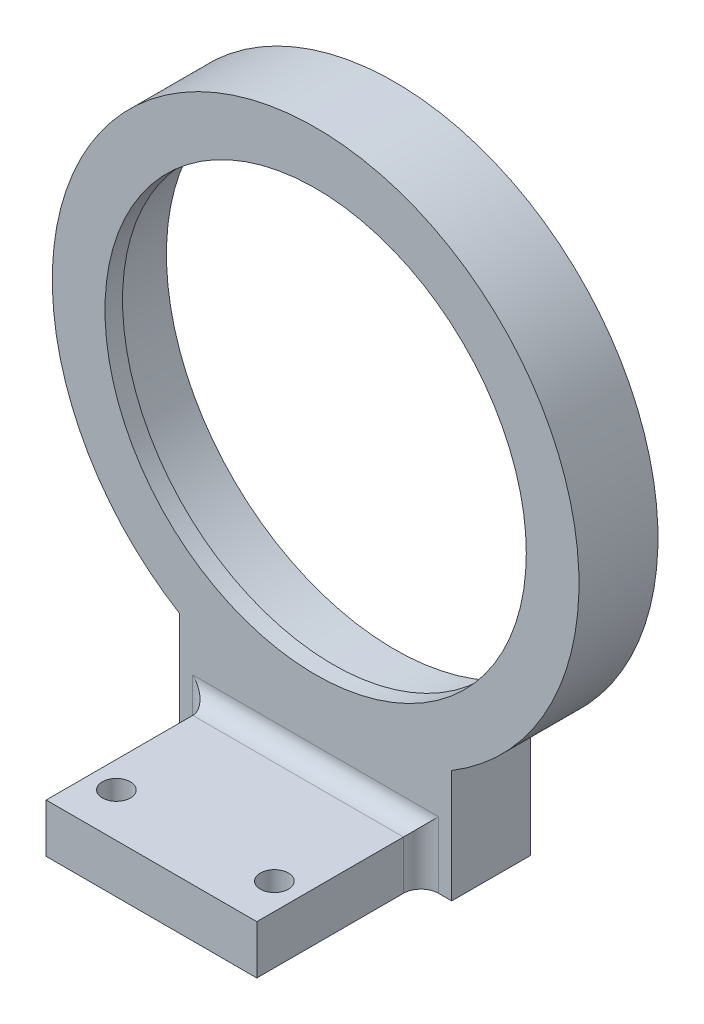
ISO-10303-21;
HEADER;
FILE_DESCRIPTION(('STEP AP214'),'2;1');
FILE_NAME('part.step','',(''),(''),'','','');
FILE_SCHEMA(('AUTOMOTIVE_DESIGN { 1 0 10303 214 1 1 1 1 }'));
ENDSEC;
DATA;
#1=APPLICATION_CONTEXT('core data for automotive mechanical design processes');
#2=APPLICATION_PROTOCOL_DEFINITION('international standard','automotive_design',2000,#1);
#3=PRODUCT_CONTEXT('',#1,'mechanical');
#4=PRODUCT('Part','Part','',(#3));
#5=PRODUCT_RELATED_PRODUCT_CATEGORY('part','',(#4));
#6=PRODUCT_DEFINITION_FORMATION('','',#4);
#7=PRODUCT_DEFINITION_CONTEXT('part definition',#1,'design');
#8=PRODUCT_DEFINITION('design','',#6,#7);
#9=PRODUCT_DEFINITION_SHAPE('','',#8);
#10=(LENGTH_UNIT() NAMED_UNIT(*) SI_UNIT(.MILLI.,.METRE.));
#11=(NAMED_UNIT(*) PLANE_ANGLE_UNIT() SI_UNIT($,.RADIAN.));
#12=(NAMED_UNIT(*) SI_UNIT($,.STERADIAN.) SOLID_ANGLE_UNIT());
#13=UNCERTAINTY_MEASURE_WITH_UNIT(LENGTH_MEASURE(1.E-05),#10,'distance_accuracy_value','');
#14=(GEOMETRIC_REPRESENTATION_CONTEXT(3) GLOBAL_UNCERTAINTY_ASSIGNED_CONTEXT((#13)) GLOBAL_UNIT_ASSIGNED_CONTEXT((#10,
#11,#12)) REPRESENTATION_CONTEXT('',''));
#15=CARTESIAN_POINT('',(0.,0.,0.));
#16=DIRECTION('',(0.,0.,1.));
#17=DIRECTION('',(1.,0.,0.));
#18=AXIS2_PLACEMENT_3D('',#15,#16,#17);
#19=CARTESIAN_POINT('',(-14.,0.,11.));
#20=DIRECTION('',(0.,1.,0.));
#21=DIRECTION('',(0.,0.,1.));
#22=AXIS2_PLACEMENT_3D('',#19,#20,#21);
#23=CYLINDRICAL_SURFACE('',#22,2.);
#24=DIRECTION('',(0.,1.,0.));
#25=VECTOR('',#24,1.);
#26=CARTESIAN_POINT('',(-14.,0.,9.));
#27=LINE('',#26,#25);
#28=CARTESIAN_POINT('',(-14.,-38.56,9.));
#29=VERTEX_POINT('',#28);
#30=CARTESIAN_POINT('',(-14.,-31.,9.));
#31=VERTEX_POINT('',#30);
#32=EDGE_CURVE('E215',#29,#31,#27,.T.);
#33=ORIENTED_EDGE('',*,*,#32,.F.);
#34=CARTESIAN_POINT('',(-14.,-38.56,11.));
#35=DIRECTION('',(0.,-1.,0.));
#36=DIRECTION('',(0.,0.,-1.));
#37=AXIS2_PLACEMENT_3D('',#34,#35,#36);
#38=CIRCLE('',#37,2.);
#39=CARTESIAN_POINT('',(-12.,-38.56,11.));
#40=VERTEX_POINT('',#39);
#41=EDGE_CURVE('E44',#29,#40,#38,.T.);
#42=ORIENTED_EDGE('',*,*,#41,.T.);
#43=DIRECTION('',(0.,1.,0.));
#44=VECTOR('',#43,1.);
#45=CARTESIAN_POINT('',(-12.,-38.,11.));
#46=LINE('',#45,#44);
#47=CARTESIAN_POINT('',(-12.,-33.,11.));
#48=VERTEX_POINT('',#47);
#49=EDGE_CURVE('E218',#48,#40,#46,.F.);
#50=ORIENTED_EDGE('',*,*,#49,.F.);
#51=CARTESIAN_POINT('',(-14.,-31.,11.));
#52=DIRECTION('',(0.707106781186547,0.707106781186547,0.));
#53=DIRECTION('',(0.707106781186547,-0.707106781186547,0.));
#54=AXIS2_PLACEMENT_3D('',#51,#52,#53);
#55=ELLIPSE('',#54,2.82842712474619,2.);
#56=EDGE_CURVE('E11',#48,#31,#55,.T.);
#57=ORIENTED_EDGE('',*,*,#56,.T.);
#58=EDGE_LOOP('',(#33,#42,#50,#57));
#59=FACE_BOUND('',#58,.T.);
#60=ADVANCED_FACE('F37',(#59),#23,.F.);
#61=CARTESIAN_POINT('',(14.,0.,11.));
#62=DIRECTION('',(0.,-1.,0.));
#63=DIRECTION('',(1.,0.,0.));
#64=AXIS2_PLACEMENT_3D('',#61,#62,#63);
#65=CYLINDRICAL_SURFACE('',#64,2.);
#66=DIRECTION('',(0.,-1.,0.));
#67=VECTOR('',#66,1.);
#68=CARTESIAN_POINT('',(14.,0.,9.));
#69=LINE('',#68,#67);
#70=CARTESIAN_POINT('',(14.,-31.,9.));
#71=VERTEX_POINT('',#70);
#72=CARTESIAN_POINT('',(14.,-38.56,9.));
#73=VERTEX_POINT('',#72);
#74=EDGE_CURVE('E205',#71,#73,#69,.T.);
#75=ORIENTED_EDGE('',*,*,#74,.F.);
#76=CARTESIAN_POINT('',(14.,-31.,11.));
#77=DIRECTION('',(0.707106781186548,-0.707106781186547,0.));
#78=DIRECTION('',(0.707106781186547,0.707106781186548,0.));
#79=AXIS2_PLACEMENT_3D('',#76,#77,#78);
#80=ELLIPSE('',#79,2.82842712474619,2.);
#81=CARTESIAN_POINT('',(12.,-33.,11.));
#82=VERTEX_POINT('',#81);
#83=EDGE_CURVE('E211',#71,#82,#80,.F.);
#84=ORIENTED_EDGE('',*,*,#83,.T.);
#85=DIRECTION('',(0.,-1.,0.));
#86=VECTOR('',#85,1.);
#87=CARTESIAN_POINT('',(12.,-38.,11.));
#88=LINE('',#87,#86);
#89=CARTESIAN_POINT('',(12.,-38.56,11.));
#90=VERTEX_POINT('',#89);
#91=EDGE_CURVE('E208',#90,#82,#88,.F.);
#92=ORIENTED_EDGE('',*,*,#91,.F.);
#93=CARTESIAN_POINT('',(14.,-38.56,11.));
#94=DIRECTION('',(0.,-1.,0.));
#95=DIRECTION('',(0.,0.,-1.));
#96=AXIS2_PLACEMENT_3D('',#93,#94,#95);
#97=CIRCLE('',#96,2.);
#98=EDGE_CURVE('E213',#90,#73,#97,.T.);
#99=ORIENTED_EDGE('',*,*,#98,.T.);
#100=EDGE_LOOP('',(#75,#84,#92,#99));
#101=FACE_BOUND('',#100,.T.);
#102=ADVANCED_FACE('F248',(#101),#65,.F.);
#103=CARTESIAN_POINT('',(0.,-31.,11.));
#104=DIRECTION('',(1.,0.,0.));
#105=DIRECTION('',(0.,0.,-1.));
#106=AXIS2_PLACEMENT_3D('',#103,#104,#105);
#107=CYLINDRICAL_SURFACE('',#106,2.);
#108=DIRECTION('',(1.,0.,0.));
#109=VECTOR('',#108,1.);
#110=CARTESIAN_POINT('',(0.,-31.,9.));
#111=LINE('',#110,#109);
#112=EDGE_CURVE('E58',#31,#71,#111,.T.);
#113=ORIENTED_EDGE('',*,*,#112,.F.);
#114=ORIENTED_EDGE('',*,*,#56,.F.);
#115=DIRECTION('',(1.,0.,0.));
#116=VECTOR('',#115,1.);
#117=CARTESIAN_POINT('',(-12.,-33.,11.));
#118=LINE('',#117,#116);
#119=EDGE_CURVE('E202',#82,#48,#118,.F.);
#120=ORIENTED_EDGE('',*,*,#119,.F.);
#121=ORIENTED_EDGE('',*,*,#83,.F.);
#122=EDGE_LOOP('',(#113,#114,#120,#121));
#123=FACE_BOUND('',#122,.T.);
#124=ADVANCED_FACE('F234',(#123),#107,.F.);
#125=CARTESIAN_POINT('',(0.,0.,7.));
#126=DIRECTION('',(0.,0.,-1.));
#127=DIRECTION('',(-1.,0.,0.));
#128=AXIS2_PLACEMENT_3D('',#125,#126,#127);
#129=CYLINDRICAL_SURFACE('',#128,30.);
#130=DIRECTION('',(0.,0.,-1.));
#131=VECTOR('',#130,1.);
#132=CARTESIAN_POINT('',(-15.5,-25.6855990780826,7.));
#133=LINE('',#132,#131);
#134=CARTESIAN_POINT('',(-15.5,-25.6855990780826,9.));
#135=VERTEX_POINT('',#134);
#136=CARTESIAN_POINT('',(-15.5,-25.6855990780826,0.));
#137=VERTEX_POINT('',#136);
#138=EDGE_CURVE('E195',#135,#137,#133,.T.);
#139=ORIENTED_EDGE('',*,*,#138,.F.);
#140=CARTESIAN_POINT('',(0.,0.,9.));
#141=DIRECTION('',(0.,0.,1.));
#142=DIRECTION('',(1.,0.,0.));
#143=AXIS2_PLACEMENT_3D('',#140,#141,#142);
#144=CIRCLE('',#143,30.);
#145=CARTESIAN_POINT('',(15.5,-25.6855990780826,9.));
#146=VERTEX_POINT('',#145);
#147=EDGE_CURVE('E181',#146,#135,#144,.T.);
#148=ORIENTED_EDGE('',*,*,#147,.F.);
#149=DIRECTION('',(0.,0.,-1.));
#150=VECTOR('',#149,1.);
#151=CARTESIAN_POINT('',(15.5,-25.6855990780826,7.));
#152=LINE('',#151,#150);
#153=CARTESIAN_POINT('',(15.5,-25.6855990780826,0.));
#154=VERTEX_POINT('',#153);
#155=EDGE_CURVE('E122',#146,#154,#152,.T.);
#156=ORIENTED_EDGE('',*,*,#155,.T.);
#157=CARTESIAN_POINT('',(0.,0.,0.));
#158=DIRECTION('',(0.,0.,1.));
#159=DIRECTION('',(1.,0.,0.));
#160=AXIS2_PLACEMENT_3D('',#157,#158,#159);
#161=CIRCLE('',#160,30.);
#162=EDGE_CURVE('E119',#154,#137,#161,.T.);
#163=ORIENTED_EDGE('',*,*,#162,.T.);
#164=EDGE_LOOP('',(#139,#148,#156,#163));
#165=FACE_BOUND('',#164,.T.);
#166=ADVANCED_FACE('F245',(#165),#129,.T.);
#167=CARTESIAN_POINT('',(0.,0.,0.));
#168=DIRECTION('',(0.,0.,1.));
#169=DIRECTION('',(1.,0.,0.));
#170=AXIS2_PLACEMENT_3D('',#167,#168,#169);
#171=PLANE('',#170);
#172=ORIENTED_EDGE('',*,*,#162,.F.);
#173=DIRECTION('',(0.,1.,0.));
#174=VECTOR('',#173,1.);
#175=CARTESIAN_POINT('',(15.5,-38.,0.));
#176=LINE('',#175,#174);
#177=CARTESIAN_POINT('',(15.5,-38.56,0.));
#178=VERTEX_POINT('',#177);
#179=EDGE_CURVE('E112',#178,#154,#176,.T.);
#180=ORIENTED_EDGE('',*,*,#179,.F.);
#181=DIRECTION('',(1.,0.,0.));
#182=VECTOR('',#181,1.);
#183=CARTESIAN_POINT('',(-15.5,-38.56,0.));
#184=LINE('',#183,#182);
#185=CARTESIAN_POINT('',(-15.5,-38.56,0.));
#186=VERTEX_POINT('',#185);
#187=EDGE_CURVE('E117',#186,#178,#184,.T.);
#188=ORIENTED_EDGE('',*,*,#187,.F.);
#189=DIRECTION('',(0.,-1.,0.));
#190=VECTOR('',#189,1.);
#191=CARTESIAN_POINT('',(-15.5,-38.,0.));
#192=LINE('',#191,#190);
#193=EDGE_CURVE('E123',#137,#186,#192,.T.);
#194=ORIENTED_EDGE('',*,*,#193,.F.);
#195=EDGE_LOOP('',(#172,#180,#188,#194));
#196=FACE_BOUND('',#195,.T.);
#197=CARTESIAN_POINT('',(0.,0.,0.));
#198=DIRECTION('',(0.,0.,1.));
#199=DIRECTION('',(1.,0.,0.));
#200=AXIS2_PLACEMENT_3D('',#197,#198,#199);
#201=CIRCLE('',#200,26.);
#202=CARTESIAN_POINT('',(26.,0.,0.));
#203=VERTEX_POINT('',#202);
#204=EDGE_CURVE('E189',#203,#203,#201,.T.);
#205=ORIENTED_EDGE('',*,*,#204,.T.);
#206=EDGE_LOOP('',(#205));
#207=FACE_BOUND('',#206,.T.);
#208=ADVANCED_FACE('F114',(#196,#207),#171,.F.);
#209=CARTESIAN_POINT('',(-15.5,-38.,7.));
#210=DIRECTION('',(1.,0.,0.));
#211=DIRECTION('',(0.,0.,-1.));
#212=AXIS2_PLACEMENT_3D('',#209,#210,#211);
#213=PLANE('',#212);
#214=ORIENTED_EDGE('',*,*,#193,.T.);
#215=DIRECTION('',(0.,0.,-1.));
#216=VECTOR('',#215,1.);
#217=CARTESIAN_POINT('',(-15.5,-38.56,9.));
#218=LINE('',#217,#216);
#219=CARTESIAN_POINT('',(-15.5,-38.56,9.));
#220=VERTEX_POINT('',#219);
#221=EDGE_CURVE('E139',#220,#186,#218,.T.);
#222=ORIENTED_EDGE('',*,*,#221,.F.);
#223=DIRECTION('',(0.,-1.,0.));
#224=VECTOR('',#223,1.);
#225=CARTESIAN_POINT('',(-15.5,-25.6855990780826,9.));
#226=LINE('',#225,#224);
#227=EDGE_CURVE('E161',#135,#220,#226,.T.);
#228=ORIENTED_EDGE('',*,*,#227,.F.);
#229=ORIENTED_EDGE('',*,*,#138,.T.);
#230=EDGE_LOOP('',(#214,#222,#228,#229));
#231=FACE_BOUND('',#230,.T.);
#232=ADVANCED_FACE('F243',(#231),#213,.F.);
#233=CARTESIAN_POINT('',(15.5,-38.,7.));
#234=DIRECTION('',(-1.,0.,0.));
#235=DIRECTION('',(0.,0.,1.));
#236=AXIS2_PLACEMENT_3D('',#233,#234,#235);
#237=PLANE('',#236);
#238=ORIENTED_EDGE('',*,*,#179,.T.);
#239=ORIENTED_EDGE('',*,*,#155,.F.);
#240=DIRECTION('',(0.,1.,0.));
#241=VECTOR('',#240,1.);
#242=CARTESIAN_POINT('',(15.5,-38.,9.));
#243=LINE('',#242,#241);
#244=CARTESIAN_POINT('',(15.5,-38.56,9.));
#245=VERTEX_POINT('',#244);
#246=EDGE_CURVE('E129',#245,#146,#243,.T.);
#247=ORIENTED_EDGE('',*,*,#246,.F.);
#248=DIRECTION('',(0.,0.,1.));
#249=VECTOR('',#248,1.);
#250=CARTESIAN_POINT('',(15.5,-38.56,0.));
#251=LINE('',#250,#249);
#252=EDGE_CURVE('E126',#178,#245,#251,.T.);
#253=ORIENTED_EDGE('',*,*,#252,.F.);
#254=EDGE_LOOP('',(#238,#239,#247,#253));
#255=FACE_BOUND('',#254,.T.);
#256=ADVANCED_FACE('F127',(#255),#237,.F.);
#257=CARTESIAN_POINT('',(0.,0.,7.));
#258=DIRECTION('',(0.,0.,-1.));
#259=DIRECTION('',(-1.,0.,0.));
#260=AXIS2_PLACEMENT_3D('',#257,#258,#259);
#261=CYLINDRICAL_SURFACE('',#260,26.);
#262=CARTESIAN_POINT('',(0.,0.,7.));
#263=DIRECTION('',(0.,0.,1.));
#264=DIRECTION('',(1.,0.,0.));
#265=AXIS2_PLACEMENT_3D('',#262,#263,#264);
#266=CIRCLE('',#265,26.);
#267=CARTESIAN_POINT('',(26.,0.,7.));
#268=VERTEX_POINT('',#267);
#269=EDGE_CURVE('E186',#268,#268,#266,.T.);
#270=ORIENTED_EDGE('',*,*,#269,.T.);
#271=EDGE_LOOP('',(#270));
#272=FACE_BOUND('',#271,.T.);
#273=ORIENTED_EDGE('',*,*,#204,.F.);
#274=EDGE_LOOP('',(#273));
#275=FACE_BOUND('',#274,.T.);
#276=ADVANCED_FACE('F277',(#272,#275),#261,.F.);
#277=CARTESIAN_POINT('',(0.,0.,9.));
#278=DIRECTION('',(0.,0.,1.));
#279=DIRECTION('',(1.,0.,0.));
#280=AXIS2_PLACEMENT_3D('',#277,#278,#279);
#281=PLANE('',#280);
#282=DIRECTION('',(-1.,0.,0.));
#283=VECTOR('',#282,1.);
#284=CARTESIAN_POINT('',(-12.,-38.56,9.));
#285=LINE('',#284,#283);
#286=EDGE_CURVE('E158',#29,#220,#285,.T.);
#287=ORIENTED_EDGE('',*,*,#286,.F.);
#288=ORIENTED_EDGE('',*,*,#32,.T.);
#289=ORIENTED_EDGE('',*,*,#112,.T.);
#290=ORIENTED_EDGE('',*,*,#74,.T.);
#291=DIRECTION('',(-1.,0.,0.));
#292=VECTOR('',#291,1.);
#293=CARTESIAN_POINT('',(15.5,-38.56,9.));
#294=LINE('',#293,#292);
#295=EDGE_CURVE('E133',#245,#73,#294,.T.);
#296=ORIENTED_EDGE('',*,*,#295,.F.);
#297=ORIENTED_EDGE('',*,*,#246,.T.);
#298=ORIENTED_EDGE('',*,*,#147,.T.);
#299=ORIENTED_EDGE('',*,*,#227,.T.);
#300=EDGE_LOOP('',(#287,#288,#289,#290,#296,#297,#298,#299));
#301=FACE_BOUND('',#300,.T.);
#302=CARTESIAN_POINT('',(0.,0.,9.));
#303=DIRECTION('',(0.,0.,1.));
#304=DIRECTION('',(1.,0.,0.));
#305=AXIS2_PLACEMENT_3D('',#302,#303,#304);
#306=CIRCLE('',#305,24.);
#307=CARTESIAN_POINT('',(24.,0.,9.));
#308=VERTEX_POINT('',#307);
#309=EDGE_CURVE('E178',#308,#308,#306,.T.);
#310=ORIENTED_EDGE('',*,*,#309,.F.);
#311=EDGE_LOOP('',(#310));
#312=FACE_BOUND('',#311,.T.);
#313=ADVANCED_FACE('F238',(#301,#312),#281,.T.);
#314=CARTESIAN_POINT('',(0.,0.,7.));
#315=DIRECTION('',(0.,0.,1.));
#316=DIRECTION('',(1.,0.,0.));
#317=AXIS2_PLACEMENT_3D('',#314,#315,#316);
#318=PLANE('',#317);
#319=ORIENTED_EDGE('',*,*,#269,.F.);
#320=EDGE_LOOP('',(#319));
#321=FACE_BOUND('',#320,.T.);
#322=CARTESIAN_POINT('',(0.,0.,7.));
#323=DIRECTION('',(0.,0.,1.));
#324=DIRECTION('',(1.,0.,0.));
#325=AXIS2_PLACEMENT_3D('',#322,#323,#324);
#326=CIRCLE('',#325,24.);
#327=CARTESIAN_POINT('',(24.,0.,7.));
#328=VERTEX_POINT('',#327);
#329=EDGE_CURVE('E177',#328,#328,#326,.T.);
#330=ORIENTED_EDGE('',*,*,#329,.T.);
#331=EDGE_LOOP('',(#330));
#332=FACE_BOUND('',#331,.T.);
#333=ADVANCED_FACE('F283',(#321,#332),#318,.F.);
#334=CARTESIAN_POINT('',(0.,0.,9.));
#335=DIRECTION('',(0.,0.,-1.));
#336=DIRECTION('',(-1.,0.,0.));
#337=AXIS2_PLACEMENT_3D('',#334,#335,#336);
#338=CYLINDRICAL_SURFACE('',#337,24.);
#339=ORIENTED_EDGE('',*,*,#309,.T.);
#340=EDGE_LOOP('',(#339));
#341=FACE_BOUND('',#340,.T.);
#342=ORIENTED_EDGE('',*,*,#329,.F.);
#343=EDGE_LOOP('',(#342));
#344=FACE_BOUND('',#343,.T.);
#345=ADVANCED_FACE('F259',(#341,#344),#338,.F.);
#346=CARTESIAN_POINT('',(-12.,-38.,27.7));
#347=DIRECTION('',(1.,0.,0.));
#348=DIRECTION('',(0.,0.,-1.));
#349=AXIS2_PLACEMENT_3D('',#346,#347,#348);
#350=PLANE('',#349);
#351=DIRECTION('',(0.,0.,-1.));
#352=VECTOR('',#351,1.);
#353=CARTESIAN_POINT('',(-12.,-33.,27.7));
#354=LINE('',#353,#352);
#355=CARTESIAN_POINT('',(-12.,-33.,27.7));
#356=VERTEX_POINT('',#355);
#357=EDGE_CURVE('E171',#356,#48,#354,.T.);
#358=ORIENTED_EDGE('',*,*,#357,.T.);
#359=ORIENTED_EDGE('',*,*,#49,.T.);
#360=DIRECTION('',(0.,0.,-1.));
#361=VECTOR('',#360,1.);
#362=CARTESIAN_POINT('',(-12.,-38.56,27.7));
#363=LINE('',#362,#361);
#364=CARTESIAN_POINT('',(-12.,-38.56,27.7));
#365=VERTEX_POINT('',#364);
#366=EDGE_CURVE('E155',#365,#40,#363,.T.);
#367=ORIENTED_EDGE('',*,*,#366,.F.);
#368=DIRECTION('',(0.,-1.,0.));
#369=VECTOR('',#368,1.);
#370=CARTESIAN_POINT('',(-12.,-38.,27.7));
#371=LINE('',#370,#369);
#372=EDGE_CURVE('E164',#356,#365,#371,.T.);
#373=ORIENTED_EDGE('',*,*,#372,.F.);
#374=EDGE_LOOP('',(#358,#359,#367,#373));
#375=FACE_BOUND('',#374,.T.);
#376=ADVANCED_FACE('F221',(#375),#350,.F.);
#377=CARTESIAN_POINT('',(12.,-38.,27.7));
#378=DIRECTION('',(-1.,0.,0.));
#379=DIRECTION('',(0.,-1.,0.));
#380=AXIS2_PLACEMENT_3D('',#377,#378,#379);
#381=PLANE('',#380);
#382=DIRECTION('',(0.,0.,1.));
#383=VECTOR('',#382,1.);
#384=CARTESIAN_POINT('',(12.,-38.56,9.));
#385=LINE('',#384,#383);
#386=CARTESIAN_POINT('',(12.,-38.56,27.7));
#387=VERTEX_POINT('',#386);
#388=EDGE_CURVE('E150',#90,#387,#385,.T.);
#389=ORIENTED_EDGE('',*,*,#388,.F.);
#390=ORIENTED_EDGE('',*,*,#91,.T.);
#391=DIRECTION('',(0.,0.,-1.));
#392=VECTOR('',#391,1.);
#393=CARTESIAN_POINT('',(12.,-33.,27.7));
#394=LINE('',#393,#392);
#395=CARTESIAN_POINT('',(12.,-33.,27.7));
#396=VERTEX_POINT('',#395);
#397=EDGE_CURVE('E174',#396,#82,#394,.T.);
#398=ORIENTED_EDGE('',*,*,#397,.F.);
#399=DIRECTION('',(0.,1.,0.));
#400=VECTOR('',#399,1.);
#401=CARTESIAN_POINT('',(12.,-38.,27.7));
#402=LINE('',#401,#400);
#403=EDGE_CURVE('E167',#387,#396,#402,.T.);
#404=ORIENTED_EDGE('',*,*,#403,.F.);
#405=EDGE_LOOP('',(#389,#390,#398,#404));
#406=FACE_BOUND('',#405,.T.);
#407=ADVANCED_FACE('F250',(#406),#381,.F.);
#408=CARTESIAN_POINT('',(-12.,-33.,27.7));
#409=DIRECTION('',(0.,-1.,0.));
#410=DIRECTION('',(0.,0.,-1.));
#411=AXIS2_PLACEMENT_3D('',#408,#409,#410);
#412=PLANE('',#411);
#413=CARTESIAN_POINT('',(9.,-33.,22.7));
#414=DIRECTION('',(0.,1.,0.));
#415=DIRECTION('',(0.,0.,1.));
#416=AXIS2_PLACEMENT_3D('',#413,#414,#415);
#417=CIRCLE('',#416,1.6);
#418=CARTESIAN_POINT('',(9.,-33.,24.3));
#419=VERTEX_POINT('',#418);
#420=EDGE_CURVE('E199',#419,#419,#417,.T.);
#421=ORIENTED_EDGE('',*,*,#420,.F.);
#422=EDGE_LOOP('',(#421));
#423=FACE_BOUND('',#422,.T.);
#424=CARTESIAN_POINT('',(-9.,-33.,22.7));
#425=DIRECTION('',(0.,1.,0.));
#426=DIRECTION('',(0.,0.,1.));
#427=AXIS2_PLACEMENT_3D('',#424,#425,#426);
#428=CIRCLE('',#427,1.6);
#429=CARTESIAN_POINT('',(-9.,-33.,24.3));
#430=VERTEX_POINT('',#429);
#431=EDGE_CURVE('E146',#430,#430,#428,.T.);
#432=ORIENTED_EDGE('',*,*,#431,.F.);
#433=EDGE_LOOP('',(#432));
#434=FACE_BOUND('',#433,.T.);
#435=ORIENTED_EDGE('',*,*,#397,.T.);
#436=ORIENTED_EDGE('',*,*,#119,.T.);
#437=ORIENTED_EDGE('',*,*,#357,.F.);
#438=DIRECTION('',(-1.,0.,0.));
#439=VECTOR('',#438,1.);
#440=CARTESIAN_POINT('',(-12.,-33.,27.7));
#441=LINE('',#440,#439);
#442=EDGE_CURVE('E169',#396,#356,#441,.T.);
#443=ORIENTED_EDGE('',*,*,#442,.F.);
#444=EDGE_LOOP('',(#435,#436,#437,#443));
#445=FACE_BOUND('',#444,.T.);
#446=ADVANCED_FACE('F232',(#423,#434,#445),#412,.F.);
#447=CARTESIAN_POINT('',(0.,0.,27.7));
#448=DIRECTION('',(0.,0.,-1.));
#449=DIRECTION('',(-1.,0.,0.));
#450=AXIS2_PLACEMENT_3D('',#447,#448,#449);
#451=PLANE('',#450);
#452=ORIENTED_EDGE('',*,*,#372,.T.);
#453=DIRECTION('',(-1.,0.,0.));
#454=VECTOR('',#453,1.);
#455=CARTESIAN_POINT('',(12.,-38.56,27.7));
#456=LINE('',#455,#454);
#457=EDGE_CURVE('E152',#387,#365,#456,.T.);
#458=ORIENTED_EDGE('',*,*,#457,.F.);
#459=ORIENTED_EDGE('',*,*,#403,.T.);
#460=ORIENTED_EDGE('',*,*,#442,.T.);
#461=EDGE_LOOP('',(#452,#458,#459,#460));
#462=FACE_BOUND('',#461,.T.);
#463=ADVANCED_FACE('F228',(#462),#451,.F.);
#464=CARTESIAN_POINT('',(0.,-38.56,0.));
#465=DIRECTION('',(0.,-1.,0.));
#466=DIRECTION('',(0.,0.,-1.));
#467=AXIS2_PLACEMENT_3D('',#464,#465,#466);
#468=PLANE('',#467);
#469=ORIENTED_EDGE('',*,*,#41,.F.);
#470=ORIENTED_EDGE('',*,*,#286,.T.);
#471=ORIENTED_EDGE('',*,*,#221,.T.);
#472=ORIENTED_EDGE('',*,*,#187,.T.);
#473=ORIENTED_EDGE('',*,*,#252,.T.);
#474=ORIENTED_EDGE('',*,*,#295,.T.);
#475=ORIENTED_EDGE('',*,*,#98,.F.);
#476=ORIENTED_EDGE('',*,*,#388,.T.);
#477=ORIENTED_EDGE('',*,*,#457,.T.);
#478=ORIENTED_EDGE('',*,*,#366,.T.);
#479=EDGE_LOOP('',(#469,#470,#471,#472,#473,#474,#475,#476,#477,#478));
#480=FACE_BOUND('',#479,.T.);
#481=CARTESIAN_POINT('',(9.,-38.56,22.7));
#482=DIRECTION('',(0.,-1.,0.));
#483=DIRECTION('',(0.,0.,-1.));
#484=AXIS2_PLACEMENT_3D('',#481,#482,#483);
#485=CIRCLE('',#484,1.6);
#486=CARTESIAN_POINT('',(9.,-38.56,21.1));
#487=VERTEX_POINT('',#486);
#488=EDGE_CURVE('E140',#487,#487,#485,.T.);
#489=ORIENTED_EDGE('',*,*,#488,.F.);
#490=EDGE_LOOP('',(#489));
#491=FACE_BOUND('',#490,.T.);
#492=CARTESIAN_POINT('',(-9.,-38.56,22.7));
#493=DIRECTION('',(0.,-1.,0.));
#494=DIRECTION('',(0.,0.,-1.));
#495=AXIS2_PLACEMENT_3D('',#492,#493,#494);
#496=CIRCLE('',#495,1.6);
#497=CARTESIAN_POINT('',(-9.,-38.56,21.1));
#498=VERTEX_POINT('',#497);
#499=EDGE_CURVE('E143',#498,#498,#496,.T.);
#500=ORIENTED_EDGE('',*,*,#499,.F.);
#501=EDGE_LOOP('',(#500));
#502=FACE_BOUND('',#501,.T.);
#503=ADVANCED_FACE('F136',(#480,#491,#502),#468,.T.);
#504=CARTESIAN_POINT('',(-9.,-49.,22.7));
#505=DIRECTION('',(0.,1.,0.));
#506=DIRECTION('',(0.,0.,1.));
#507=AXIS2_PLACEMENT_3D('',#504,#505,#506);
#508=CYLINDRICAL_SURFACE('',#507,1.6);
#509=ORIENTED_EDGE('',*,*,#499,.T.);
#510=EDGE_LOOP('',(#509));
#511=FACE_BOUND('',#510,.T.);
#512=ORIENTED_EDGE('',*,*,#431,.T.);
#513=EDGE_LOOP('',(#512));
#514=FACE_BOUND('',#513,.T.);
#515=ADVANCED_FACE('F401',(#511,#514),#508,.F.);
#516=CARTESIAN_POINT('',(9.,-49.,22.7));
#517=DIRECTION('',(0.,1.,0.));
#518=DIRECTION('',(0.,0.,1.));
#519=AXIS2_PLACEMENT_3D('',#516,#517,#518);
#520=CYLINDRICAL_SURFACE('',#519,1.6);
#521=ORIENTED_EDGE('',*,*,#488,.T.);
#522=EDGE_LOOP('',(#521));
#523=FACE_BOUND('',#522,.T.);
#524=ORIENTED_EDGE('',*,*,#420,.T.);
#525=EDGE_LOOP('',(#524));
#526=FACE_BOUND('',#525,.T.);
#527=ADVANCED_FACE('F412',(#523,#526),#520,.F.);
#528=CLOSED_SHELL('',(#60,#102,#124,#166,#208,#232,#256,#276,#313,#333,#345,#376,#407,#446,#463,
#503,#515,#527));
#529=MANIFOLD_SOLID_BREP('B2',#528);
#530=ADVANCED_BREP_SHAPE_REPRESENTATION('',(#18,#529),#14);
#531=SHAPE_DEFINITION_REPRESENTATION(#9,#530);
ENDSEC;
END-ISO-10303-21;
